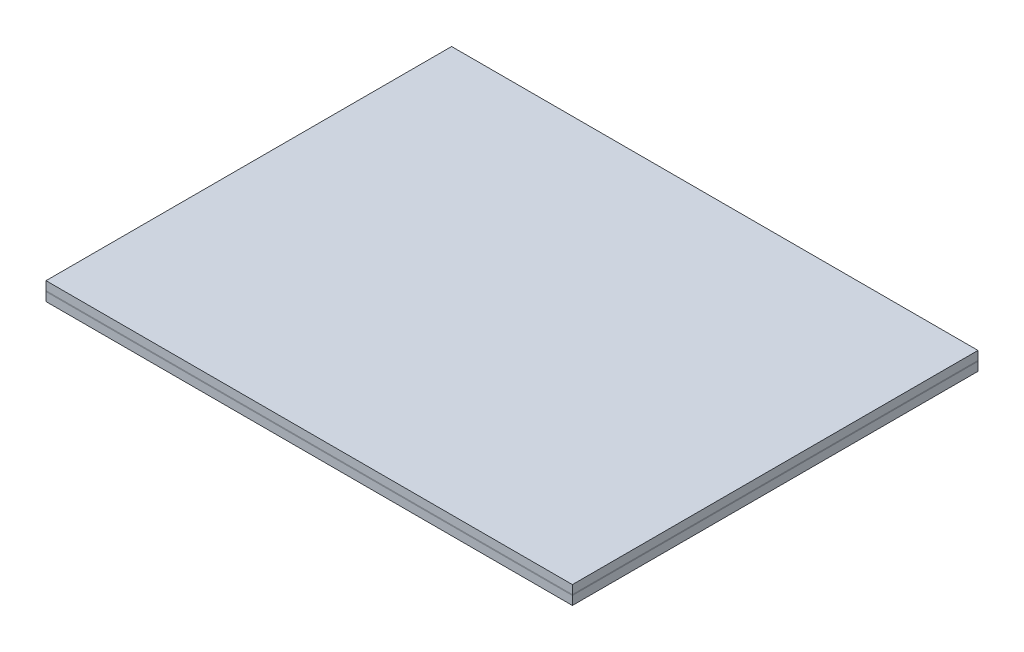
ISO-10303-21;
HEADER;
FILE_DESCRIPTION(('STEP AP214'),'2;1');
FILE_NAME('part.step','',(''),(''),'','','');
FILE_SCHEMA(('AUTOMOTIVE_DESIGN { 1 0 10303 214 1 1 1 1 }'));
ENDSEC;
DATA;
#1=APPLICATION_CONTEXT('core data for automotive mechanical design processes');
#2=APPLICATION_PROTOCOL_DEFINITION('international standard','automotive_design',2000,#1);
#3=PRODUCT_CONTEXT('',#1,'mechanical');
#4=PRODUCT('Part','Part','',(#3));
#5=PRODUCT_RELATED_PRODUCT_CATEGORY('part','',(#4));
#6=PRODUCT_DEFINITION_FORMATION('','',#4);
#7=PRODUCT_DEFINITION_CONTEXT('part definition',#1,'design');
#8=PRODUCT_DEFINITION('design','',#6,#7);
#9=PRODUCT_DEFINITION_SHAPE('','',#8);
#10=(LENGTH_UNIT() NAMED_UNIT(*) SI_UNIT(.MILLI.,.METRE.));
#11=(NAMED_UNIT(*) PLANE_ANGLE_UNIT() SI_UNIT($,.RADIAN.));
#12=(NAMED_UNIT(*) SI_UNIT($,.STERADIAN.) SOLID_ANGLE_UNIT());
#13=UNCERTAINTY_MEASURE_WITH_UNIT(LENGTH_MEASURE(1.E-05),#10,'distance_accuracy_value','');
#14=(GEOMETRIC_REPRESENTATION_CONTEXT(3) GLOBAL_UNCERTAINTY_ASSIGNED_CONTEXT((#13)) GLOBAL_UNIT_ASSIGNED_CONTEXT((#10,
#11,#12)) REPRESENTATION_CONTEXT('',''));
#15=CARTESIAN_POINT('',(0.,0.,0.));
#16=DIRECTION('',(0.,0.,1.));
#17=DIRECTION('',(1.,0.,0.));
#18=AXIS2_PLACEMENT_3D('',#15,#16,#17);
#19=CARTESIAN_POINT('',(0.,2.1,-15.0940695296524));
#20=DIRECTION('',(0.,0.,1.));
#21=DIRECTION('',(1.,0.,0.));
#22=AXIS2_PLACEMENT_3D('',#19,#20,#21);
#23=PLANE('',#22);
#24=DIRECTION('',(-1.,0.,0.));
#25=VECTOR('',#24,1.);
#26=CARTESIAN_POINT('',(0.,1.1,-15.0940695296524));
#27=LINE('',#26,#25);
#28=CARTESIAN_POINT('',(33.4314928425358,1.1,-15.0940695296524));
#29=VERTEX_POINT('',#28);
#30=CARTESIAN_POINT('',(-27.5685071574642,1.1,-15.0940695296524));
#31=VERTEX_POINT('',#30);
#32=EDGE_CURVE('E109',#29,#31,#27,.T.);
#33=ORIENTED_EDGE('',*,*,#32,.T.);
#34=DIRECTION('',(0.,-1.,0.));
#35=VECTOR('',#34,1.);
#36=CARTESIAN_POINT('',(-27.5685071574642,2.1,-15.0940695296524));
#37=LINE('',#36,#35);
#38=CARTESIAN_POINT('',(-27.5685071574642,2.1,-15.0940695296524));
#39=VERTEX_POINT('',#38);
#40=EDGE_CURVE('E12',#39,#31,#37,.T.);
#41=ORIENTED_EDGE('',*,*,#40,.F.);
#42=DIRECTION('',(-1.,0.,0.));
#43=VECTOR('',#42,1.);
#44=CARTESIAN_POINT('',(0.,2.1,-15.0940695296524));
#45=LINE('',#44,#43);
#46=CARTESIAN_POINT('',(33.4314928425358,2.1,-15.0940695296524));
#47=VERTEX_POINT('',#46);
#48=EDGE_CURVE('E97',#47,#39,#45,.T.);
#49=ORIENTED_EDGE('',*,*,#48,.F.);
#50=DIRECTION('',(0.,-1.,0.));
#51=VECTOR('',#50,1.);
#52=CARTESIAN_POINT('',(33.4314928425358,2.1,-15.0940695296524));
#53=LINE('',#52,#51);
#54=EDGE_CURVE('E105',#47,#29,#53,.T.);
#55=ORIENTED_EDGE('',*,*,#54,.T.);
#56=EDGE_LOOP('',(#33,#41,#49,#55));
#57=FACE_BOUND('',#56,.T.);
#58=ADVANCED_FACE('F46',(#57),#23,.F.);
#59=CARTESIAN_POINT('',(-27.5685071574642,2.1,0.));
#60=DIRECTION('',(1.,0.,0.));
#61=DIRECTION('',(0.,0.,-1.));
#62=AXIS2_PLACEMENT_3D('',#59,#60,#61);
#63=PLANE('',#62);
#64=DIRECTION('',(0.,0.,1.));
#65=VECTOR('',#64,1.);
#66=CARTESIAN_POINT('',(-27.5685071574642,1.1,0.));
#67=LINE('',#66,#65);
#68=CARTESIAN_POINT('',(-27.5685071574642,1.1,31.9059304703476));
#69=VERTEX_POINT('',#68);
#70=EDGE_CURVE('E101',#31,#69,#67,.T.);
#71=ORIENTED_EDGE('',*,*,#70,.T.);
#72=DIRECTION('',(0.,-1.,0.));
#73=VECTOR('',#72,1.);
#74=CARTESIAN_POINT('',(-27.5685071574642,2.1,31.9059304703476));
#75=LINE('',#74,#73);
#76=CARTESIAN_POINT('',(-27.5685071574642,2.1,31.9059304703476));
#77=VERTEX_POINT('',#76);
#78=EDGE_CURVE('E54',#77,#69,#75,.T.);
#79=ORIENTED_EDGE('',*,*,#78,.F.);
#80=DIRECTION('',(0.,0.,1.));
#81=VECTOR('',#80,1.);
#82=CARTESIAN_POINT('',(-27.5685071574642,2.1,0.));
#83=LINE('',#82,#81);
#84=EDGE_CURVE('E92',#39,#77,#83,.T.);
#85=ORIENTED_EDGE('',*,*,#84,.F.);
#86=ORIENTED_EDGE('',*,*,#40,.T.);
#87=EDGE_LOOP('',(#71,#79,#85,#86));
#88=FACE_BOUND('',#87,.T.);
#89=ADVANCED_FACE('F100',(#88),#63,.F.);
#90=CARTESIAN_POINT('',(0.,2.1,31.9059304703476));
#91=DIRECTION('',(0.,0.,-1.));
#92=DIRECTION('',(-1.,0.,0.));
#93=AXIS2_PLACEMENT_3D('',#90,#91,#92);
#94=PLANE('',#93);
#95=DIRECTION('',(1.,0.,0.));
#96=VECTOR('',#95,1.);
#97=CARTESIAN_POINT('',(0.,1.1,31.9059304703476));
#98=LINE('',#97,#96);
#99=CARTESIAN_POINT('',(33.4314928425358,1.1,31.9059304703476));
#100=VERTEX_POINT('',#99);
#101=EDGE_CURVE('E79',#69,#100,#98,.T.);
#102=ORIENTED_EDGE('',*,*,#101,.T.);
#103=DIRECTION('',(0.,-1.,0.));
#104=VECTOR('',#103,1.);
#105=CARTESIAN_POINT('',(33.4314928425358,2.1,31.9059304703476));
#106=LINE('',#105,#104);
#107=CARTESIAN_POINT('',(33.4314928425358,2.1,31.9059304703476));
#108=VERTEX_POINT('',#107);
#109=EDGE_CURVE('E102',#108,#100,#106,.T.);
#110=ORIENTED_EDGE('',*,*,#109,.F.);
#111=DIRECTION('',(1.,0.,0.));
#112=VECTOR('',#111,1.);
#113=CARTESIAN_POINT('',(0.,2.1,31.9059304703476));
#114=LINE('',#113,#112);
#115=EDGE_CURVE('E95',#77,#108,#114,.T.);
#116=ORIENTED_EDGE('',*,*,#115,.F.);
#117=ORIENTED_EDGE('',*,*,#78,.T.);
#118=EDGE_LOOP('',(#102,#110,#116,#117));
#119=FACE_BOUND('',#118,.T.);
#120=ADVANCED_FACE('F103',(#119),#94,.F.);
#121=CARTESIAN_POINT('',(33.4314928425358,2.1,0.));
#122=DIRECTION('',(-1.,0.,0.));
#123=DIRECTION('',(0.,0.,1.));
#124=AXIS2_PLACEMENT_3D('',#121,#122,#123);
#125=PLANE('',#124);
#126=DIRECTION('',(0.,0.,-1.));
#127=VECTOR('',#126,1.);
#128=CARTESIAN_POINT('',(33.4314928425358,1.1,0.));
#129=LINE('',#128,#127);
#130=EDGE_CURVE('E85',#100,#29,#129,.T.);
#131=ORIENTED_EDGE('',*,*,#130,.T.);
#132=ORIENTED_EDGE('',*,*,#54,.F.);
#133=DIRECTION('',(0.,0.,-1.));
#134=VECTOR('',#133,1.);
#135=CARTESIAN_POINT('',(33.4314928425358,2.1,0.));
#136=LINE('',#135,#134);
#137=EDGE_CURVE('E62',#108,#47,#136,.T.);
#138=ORIENTED_EDGE('',*,*,#137,.F.);
#139=ORIENTED_EDGE('',*,*,#109,.T.);
#140=EDGE_LOOP('',(#131,#132,#138,#139));
#141=FACE_BOUND('',#140,.T.);
#142=ADVANCED_FACE('F116',(#141),#125,.F.);
#143=CARTESIAN_POINT('',(0.,2.1,0.));
#144=DIRECTION('',(0.,1.,0.));
#145=DIRECTION('',(0.,0.,1.));
#146=AXIS2_PLACEMENT_3D('',#143,#144,#145);
#147=PLANE('',#146);
#148=ORIENTED_EDGE('',*,*,#48,.T.);
#149=ORIENTED_EDGE('',*,*,#84,.T.);
#150=ORIENTED_EDGE('',*,*,#115,.T.);
#151=ORIENTED_EDGE('',*,*,#137,.T.);
#152=EDGE_LOOP('',(#148,#149,#150,#151));
#153=FACE_BOUND('',#152,.T.);
#154=ADVANCED_FACE('F93',(#153),#147,.T.);
#155=CARTESIAN_POINT('',(0.,1.1,0.));
#156=DIRECTION('',(0.,1.,0.));
#157=DIRECTION('',(0.,0.,1.));
#158=AXIS2_PLACEMENT_3D('',#155,#156,#157);
#159=PLANE('',#158);
#160=ORIENTED_EDGE('',*,*,#32,.F.);
#161=ORIENTED_EDGE('',*,*,#130,.F.);
#162=ORIENTED_EDGE('',*,*,#101,.F.);
#163=ORIENTED_EDGE('',*,*,#70,.F.);
#164=EDGE_LOOP('',(#160,#161,#162,#163));
#165=FACE_BOUND('',#164,.T.);
#166=ADVANCED_FACE('F119',(#165),#159,.F.);
#167=CLOSED_SHELL('',(#58,#89,#120,#142,#154,#166));
#168=MANIFOLD_SOLID_BREP('B2',#167);
#169=CARTESIAN_POINT('',(0.,1.1,0.));
#170=DIRECTION('',(0.,-1.,0.));
#171=DIRECTION('',(0.,0.,-1.));
#172=AXIS2_PLACEMENT_3D('',#169,#170,#171);
#173=PLANE('',#172);
#174=DIRECTION('',(0.,0.,1.));
#175=VECTOR('',#174,1.);
#176=CARTESIAN_POINT('',(-27.5685071574642,1.1,31.9059304703476));
#177=LINE('',#176,#175);
#178=CARTESIAN_POINT('',(-27.5685071574642,1.1,-15.0940695296524));
#179=VERTEX_POINT('',#178);
#180=CARTESIAN_POINT('',(-27.5685071574642,1.1,31.9059304703476));
#181=VERTEX_POINT('',#180);
#182=EDGE_CURVE('E292',#179,#181,#177,.T.);
#183=ORIENTED_EDGE('',*,*,#182,.T.);
#184=DIRECTION('',(1.,0.,0.));
#185=VECTOR('',#184,1.);
#186=CARTESIAN_POINT('',(33.4314928425358,1.1,31.9059304703476));
#187=LINE('',#186,#185);
#188=CARTESIAN_POINT('',(33.4314928425358,1.1,31.9059304703476));
#189=VERTEX_POINT('',#188);
#190=EDGE_CURVE('E295',#181,#189,#187,.T.);
#191=ORIENTED_EDGE('',*,*,#190,.T.);
#192=DIRECTION('',(0.,0.,-1.));
#193=VECTOR('',#192,1.);
#194=CARTESIAN_POINT('',(33.4314928425358,1.1,-15.0940695296524));
#195=LINE('',#194,#193);
#196=CARTESIAN_POINT('',(33.4314928425358,1.1,-15.0940695296524));
#197=VERTEX_POINT('',#196);
#198=EDGE_CURVE('E298',#189,#197,#195,.T.);
#199=ORIENTED_EDGE('',*,*,#198,.T.);
#200=DIRECTION('',(-1.,0.,0.));
#201=VECTOR('',#200,1.);
#202=CARTESIAN_POINT('',(-27.5685071574642,1.1,-15.0940695296524));
#203=LINE('',#202,#201);
#204=EDGE_CURVE('E300',#197,#179,#203,.T.);
#205=ORIENTED_EDGE('',*,*,#204,.T.);
#206=EDGE_LOOP('',(#183,#191,#199,#205));
#207=FACE_BOUND('',#206,.T.);
#208=DIRECTION('',(-1.,0.,0.));
#209=VECTOR('',#208,1.);
#210=CARTESIAN_POINT('',(31.9314928425358,1.1,-13.5940695296524));
#211=LINE('',#210,#209);
#212=CARTESIAN_POINT('',(31.9314928425358,1.1,-13.5940695296524));
#213=VERTEX_POINT('',#212);
#214=CARTESIAN_POINT('',(-25.0685071574642,1.1,-13.5940695296524));
#215=VERTEX_POINT('',#214);
#216=EDGE_CURVE('E256',#213,#215,#211,.T.);
#217=ORIENTED_EDGE('',*,*,#216,.F.);
#218=DIRECTION('',(0.,0.,-1.));
#219=VECTOR('',#218,1.);
#220=CARTESIAN_POINT('',(31.9314928425358,1.1,30.4059304703476));
#221=LINE('',#220,#219);
#222=CARTESIAN_POINT('',(31.9314928425358,1.1,30.4059304703476));
#223=VERTEX_POINT('',#222);
#224=EDGE_CURVE('E278',#223,#213,#221,.T.);
#225=ORIENTED_EDGE('',*,*,#224,.F.);
#226=DIRECTION('',(1.,0.,0.));
#227=VECTOR('',#226,1.);
#228=CARTESIAN_POINT('',(-25.0685071574642,1.1,30.4059304703476));
#229=LINE('',#228,#227);
#230=CARTESIAN_POINT('',(-25.0685071574642,1.1,30.4059304703476));
#231=VERTEX_POINT('',#230);
#232=EDGE_CURVE('E276',#231,#223,#229,.T.);
#233=ORIENTED_EDGE('',*,*,#232,.F.);
#234=DIRECTION('',(0.,0.,1.));
#235=VECTOR('',#234,1.);
#236=CARTESIAN_POINT('',(-25.0685071574642,1.1,-13.5940695296524));
#237=LINE('',#236,#235);
#238=EDGE_CURVE('E264',#215,#231,#237,.T.);
#239=ORIENTED_EDGE('',*,*,#238,.F.);
#240=EDGE_LOOP('',(#217,#225,#233,#239));
#241=FACE_BOUND('',#240,.T.);
#242=ADVANCED_FACE('F191',(#207,#241),#173,.F.);
#243=CARTESIAN_POINT('',(0.,1.,0.));
#244=DIRECTION('',(0.,-1.,0.));
#245=DIRECTION('',(0.,0.,-1.));
#246=AXIS2_PLACEMENT_3D('',#243,#244,#245);
#247=PLANE('',#246);
#248=DIRECTION('',(0.,0.,1.));
#249=VECTOR('',#248,1.);
#250=CARTESIAN_POINT('',(-27.5685071574642,1.,31.9059304703476));
#251=LINE('',#250,#249);
#252=CARTESIAN_POINT('',(-27.5685071574642,1.,-15.0940695296524));
#253=VERTEX_POINT('',#252);
#254=CARTESIAN_POINT('',(-27.5685071574642,1.,31.9059304703476));
#255=VERTEX_POINT('',#254);
#256=EDGE_CURVE('E272',#253,#255,#251,.T.);
#257=ORIENTED_EDGE('',*,*,#256,.F.);
#258=DIRECTION('',(-1.,0.,0.));
#259=VECTOR('',#258,1.);
#260=CARTESIAN_POINT('',(-27.5685071574642,1.,-15.0940695296524));
#261=LINE('',#260,#259);
#262=CARTESIAN_POINT('',(33.4314928425358,1.,-15.0940695296524));
#263=VERTEX_POINT('',#262);
#264=EDGE_CURVE('E296',#263,#253,#261,.T.);
#265=ORIENTED_EDGE('',*,*,#264,.F.);
#266=DIRECTION('',(0.,0.,-1.));
#267=VECTOR('',#266,1.);
#268=CARTESIAN_POINT('',(33.4314928425358,1.,-15.0940695296524));
#269=LINE('',#268,#267);
#270=CARTESIAN_POINT('',(33.4314928425358,1.,31.9059304703476));
#271=VERTEX_POINT('',#270);
#272=EDGE_CURVE('E307',#271,#263,#269,.T.);
#273=ORIENTED_EDGE('',*,*,#272,.F.);
#274=DIRECTION('',(1.,0.,0.));
#275=VECTOR('',#274,1.);
#276=CARTESIAN_POINT('',(33.4314928425358,1.,31.9059304703476));
#277=LINE('',#276,#275);
#278=EDGE_CURVE('E305',#255,#271,#277,.T.);
#279=ORIENTED_EDGE('',*,*,#278,.F.);
#280=EDGE_LOOP('',(#257,#265,#273,#279));
#281=FACE_BOUND('',#280,.T.);
#282=DIRECTION('',(0.,0.,-1.));
#283=VECTOR('',#282,1.);
#284=CARTESIAN_POINT('',(31.9314928425358,1.,30.4059304703476));
#285=LINE('',#284,#283);
#286=CARTESIAN_POINT('',(31.9314928425358,1.,30.4059304703476));
#287=VERTEX_POINT('',#286);
#288=CARTESIAN_POINT('',(31.9314928425358,1.,-13.5940695296524));
#289=VERTEX_POINT('',#288);
#290=EDGE_CURVE('E265',#287,#289,#285,.T.);
#291=ORIENTED_EDGE('',*,*,#290,.T.);
#292=DIRECTION('',(-1.,0.,0.));
#293=VECTOR('',#292,1.);
#294=CARTESIAN_POINT('',(31.9314928425358,1.,-13.5940695296524));
#295=LINE('',#294,#293);
#296=CARTESIAN_POINT('',(-25.0685071574642,1.,-13.5940695296524));
#297=VERTEX_POINT('',#296);
#298=EDGE_CURVE('E214',#289,#297,#295,.T.);
#299=ORIENTED_EDGE('',*,*,#298,.T.);
#300=DIRECTION('',(0.,0.,1.));
#301=VECTOR('',#300,1.);
#302=CARTESIAN_POINT('',(-25.0685071574642,1.,-13.5940695296524));
#303=LINE('',#302,#301);
#304=CARTESIAN_POINT('',(-25.0685071574642,1.,30.4059304703476));
#305=VERTEX_POINT('',#304);
#306=EDGE_CURVE('E271',#297,#305,#303,.T.);
#307=ORIENTED_EDGE('',*,*,#306,.T.);
#308=DIRECTION('',(1.,0.,0.));
#309=VECTOR('',#308,1.);
#310=CARTESIAN_POINT('',(-25.0685071574642,1.,30.4059304703476));
#311=LINE('',#310,#309);
#312=EDGE_CURVE('E284',#305,#287,#311,.T.);
#313=ORIENTED_EDGE('',*,*,#312,.T.);
#314=EDGE_LOOP('',(#291,#299,#307,#313));
#315=FACE_BOUND('',#314,.T.);
#316=ADVANCED_FACE('F325',(#281,#315),#247,.T.);
#317=CARTESIAN_POINT('',(-27.5685071574642,1.1,31.9059304703476));
#318=DIRECTION('',(1.,0.,0.));
#319=DIRECTION('',(0.,0.,-1.));
#320=AXIS2_PLACEMENT_3D('',#317,#318,#319);
#321=PLANE('',#320);
#322=ORIENTED_EDGE('',*,*,#256,.T.);
#323=DIRECTION('',(0.,-1.,0.));
#324=VECTOR('',#323,1.);
#325=CARTESIAN_POINT('',(-27.5685071574642,1.1,31.9059304703476));
#326=LINE('',#325,#324);
#327=EDGE_CURVE('E44',#181,#255,#326,.T.);
#328=ORIENTED_EDGE('',*,*,#327,.F.);
#329=ORIENTED_EDGE('',*,*,#182,.F.);
#330=DIRECTION('',(0.,-1.,0.));
#331=VECTOR('',#330,1.);
#332=CARTESIAN_POINT('',(-27.5685071574642,1.1,-15.0940695296524));
#333=LINE('',#332,#331);
#334=EDGE_CURVE('E302',#179,#253,#333,.T.);
#335=ORIENTED_EDGE('',*,*,#334,.T.);
#336=EDGE_LOOP('',(#322,#328,#329,#335));
#337=FACE_BOUND('',#336,.T.);
#338=ADVANCED_FACE('F193',(#337),#321,.F.);
#339=CARTESIAN_POINT('',(33.4314928425358,1.1,31.9059304703476));
#340=DIRECTION('',(0.,0.,-1.));
#341=DIRECTION('',(-1.,0.,0.));
#342=AXIS2_PLACEMENT_3D('',#339,#340,#341);
#343=PLANE('',#342);
#344=ORIENTED_EDGE('',*,*,#278,.T.);
#345=DIRECTION('',(0.,-1.,0.));
#346=VECTOR('',#345,1.);
#347=CARTESIAN_POINT('',(33.4314928425358,1.1,31.9059304703476));
#348=LINE('',#347,#346);
#349=EDGE_CURVE('E199',#189,#271,#348,.T.);
#350=ORIENTED_EDGE('',*,*,#349,.F.);
#351=ORIENTED_EDGE('',*,*,#190,.F.);
#352=ORIENTED_EDGE('',*,*,#327,.T.);
#353=EDGE_LOOP('',(#344,#350,#351,#352));
#354=FACE_BOUND('',#353,.T.);
#355=ADVANCED_FACE('F335',(#354),#343,.F.);
#356=CARTESIAN_POINT('',(33.4314928425358,1.1,-15.0940695296524));
#357=DIRECTION('',(-1.,0.,0.));
#358=DIRECTION('',(0.,0.,1.));
#359=AXIS2_PLACEMENT_3D('',#356,#357,#358);
#360=PLANE('',#359);
#361=ORIENTED_EDGE('',*,*,#272,.T.);
#362=DIRECTION('',(0.,-1.,0.));
#363=VECTOR('',#362,1.);
#364=CARTESIAN_POINT('',(33.4314928425358,1.1,-15.0940695296524));
#365=LINE('',#364,#363);
#366=EDGE_CURVE('E312',#197,#263,#365,.T.);
#367=ORIENTED_EDGE('',*,*,#366,.F.);
#368=ORIENTED_EDGE('',*,*,#198,.F.);
#369=ORIENTED_EDGE('',*,*,#349,.T.);
#370=EDGE_LOOP('',(#361,#367,#368,#369));
#371=FACE_BOUND('',#370,.T.);
#372=ADVANCED_FACE('F319',(#371),#360,.F.);
#373=CARTESIAN_POINT('',(-27.5685071574642,1.1,-15.0940695296524));
#374=DIRECTION('',(0.,0.,1.));
#375=DIRECTION('',(1.,0.,0.));
#376=AXIS2_PLACEMENT_3D('',#373,#374,#375);
#377=PLANE('',#376);
#378=ORIENTED_EDGE('',*,*,#264,.T.);
#379=ORIENTED_EDGE('',*,*,#334,.F.);
#380=ORIENTED_EDGE('',*,*,#204,.F.);
#381=ORIENTED_EDGE('',*,*,#366,.T.);
#382=EDGE_LOOP('',(#378,#379,#380,#381));
#383=FACE_BOUND('',#382,.T.);
#384=ADVANCED_FACE('F329',(#383),#377,.F.);
#385=CARTESIAN_POINT('',(31.9314928425358,1.1,-13.5940695296524));
#386=DIRECTION('',(0.,0.,1.));
#387=DIRECTION('',(1.,0.,0.));
#388=AXIS2_PLACEMENT_3D('',#385,#386,#387);
#389=PLANE('',#388);
#390=ORIENTED_EDGE('',*,*,#298,.F.);
#391=DIRECTION('',(0.,-1.,0.));
#392=VECTOR('',#391,1.);
#393=CARTESIAN_POINT('',(31.9314928425358,1.1,-13.5940695296524));
#394=LINE('',#393,#392);
#395=EDGE_CURVE('E260',#213,#289,#394,.T.);
#396=ORIENTED_EDGE('',*,*,#395,.F.);
#397=ORIENTED_EDGE('',*,*,#216,.T.);
#398=DIRECTION('',(0.,-1.,0.));
#399=VECTOR('',#398,1.);
#400=CARTESIAN_POINT('',(-25.0685071574642,1.1,-13.5940695296524));
#401=LINE('',#400,#399);
#402=EDGE_CURVE('E259',#215,#297,#401,.T.);
#403=ORIENTED_EDGE('',*,*,#402,.T.);
#404=EDGE_LOOP('',(#390,#396,#397,#403));
#405=FACE_BOUND('',#404,.T.);
#406=ADVANCED_FACE('F258',(#405),#389,.T.);
#407=CARTESIAN_POINT('',(-25.0685071574642,1.1,-13.5940695296524));
#408=DIRECTION('',(1.,0.,0.));
#409=DIRECTION('',(0.,0.,-1.));
#410=AXIS2_PLACEMENT_3D('',#407,#408,#409);
#411=PLANE('',#410);
#412=ORIENTED_EDGE('',*,*,#306,.F.);
#413=ORIENTED_EDGE('',*,*,#402,.F.);
#414=ORIENTED_EDGE('',*,*,#238,.T.);
#415=DIRECTION('',(0.,-1.,0.));
#416=VECTOR('',#415,1.);
#417=CARTESIAN_POINT('',(-25.0685071574642,1.1,30.4059304703476));
#418=LINE('',#417,#416);
#419=EDGE_CURVE('E273',#231,#305,#418,.T.);
#420=ORIENTED_EDGE('',*,*,#419,.T.);
#421=EDGE_LOOP('',(#412,#413,#414,#420));
#422=FACE_BOUND('',#421,.T.);
#423=ADVANCED_FACE('F268',(#422),#411,.T.);
#424=CARTESIAN_POINT('',(-25.0685071574642,1.1,30.4059304703476));
#425=DIRECTION('',(0.,0.,-1.));
#426=DIRECTION('',(-1.,0.,0.));
#427=AXIS2_PLACEMENT_3D('',#424,#425,#426);
#428=PLANE('',#427);
#429=ORIENTED_EDGE('',*,*,#312,.F.);
#430=ORIENTED_EDGE('',*,*,#419,.F.);
#431=ORIENTED_EDGE('',*,*,#232,.T.);
#432=DIRECTION('',(0.,-1.,0.));
#433=VECTOR('',#432,1.);
#434=CARTESIAN_POINT('',(31.9314928425358,1.1,30.4059304703476));
#435=LINE('',#434,#433);
#436=EDGE_CURVE('E206',#223,#287,#435,.T.);
#437=ORIENTED_EDGE('',*,*,#436,.T.);
#438=EDGE_LOOP('',(#429,#430,#431,#437));
#439=FACE_BOUND('',#438,.T.);
#440=ADVANCED_FACE('F358',(#439),#428,.T.);
#441=CARTESIAN_POINT('',(31.9314928425358,1.1,30.4059304703476));
#442=DIRECTION('',(-1.,0.,0.));
#443=DIRECTION('',(0.,0.,1.));
#444=AXIS2_PLACEMENT_3D('',#441,#442,#443);
#445=PLANE('',#444);
#446=ORIENTED_EDGE('',*,*,#290,.F.);
#447=ORIENTED_EDGE('',*,*,#436,.F.);
#448=ORIENTED_EDGE('',*,*,#224,.T.);
#449=ORIENTED_EDGE('',*,*,#395,.T.);
#450=EDGE_LOOP('',(#446,#447,#448,#449));
#451=FACE_BOUND('',#450,.T.);
#452=ADVANCED_FACE('F362',(#451),#445,.T.);
#453=CLOSED_SHELL('',(#242,#316,#338,#355,#372,#384,#406,#423,#440,#452));
#454=MANIFOLD_SOLID_BREP('B6',#453);
#455=CARTESIAN_POINT('',(-27.5685071574642,1.,-15.0940695296524));
#456=DIRECTION('',(1.,0.,0.));
#457=DIRECTION('',(0.,0.,-1.));
#458=AXIS2_PLACEMENT_3D('',#455,#456,#457);
#459=PLANE('',#458);
#460=DIRECTION('',(0.,0.,1.));
#461=VECTOR('',#460,1.);
#462=CARTESIAN_POINT('',(-27.5685071574642,0.,-15.0940695296524));
#463=LINE('',#462,#461);
#464=CARTESIAN_POINT('',(-27.5685071574642,0.,-15.0940695296524));
#465=VERTEX_POINT('',#464);
#466=CARTESIAN_POINT('',(-27.5685071574642,0.,31.9059304703476));
#467=VERTEX_POINT('',#466);
#468=EDGE_CURVE('E484',#465,#467,#463,.T.);
#469=ORIENTED_EDGE('',*,*,#468,.T.);
#470=DIRECTION('',(0.,-1.,0.));
#471=VECTOR('',#470,1.);
#472=CARTESIAN_POINT('',(-27.5685071574642,1.,31.9059304703476));
#473=LINE('',#472,#471);
#474=CARTESIAN_POINT('',(-27.5685071574642,1.,31.9059304703476));
#475=VERTEX_POINT('',#474);
#476=EDGE_CURVE('E189',#475,#467,#473,.T.);
#477=ORIENTED_EDGE('',*,*,#476,.F.);
#478=DIRECTION('',(0.,0.,1.));
#479=VECTOR('',#478,1.);
#480=CARTESIAN_POINT('',(-27.5685071574642,1.,-15.0940695296524));
#481=LINE('',#480,#479);
#482=CARTESIAN_POINT('',(-27.5685071574642,1.,-15.0940695296524));
#483=VERTEX_POINT('',#482);
#484=EDGE_CURVE('E472',#483,#475,#481,.T.);
#485=ORIENTED_EDGE('',*,*,#484,.F.);
#486=DIRECTION('',(0.,-1.,0.));
#487=VECTOR('',#486,1.);
#488=CARTESIAN_POINT('',(-27.5685071574642,1.,-15.0940695296524));
#489=LINE('',#488,#487);
#490=EDGE_CURVE('E480',#483,#465,#489,.T.);
#491=ORIENTED_EDGE('',*,*,#490,.T.);
#492=EDGE_LOOP('',(#469,#477,#485,#491));
#493=FACE_BOUND('',#492,.T.);
#494=ADVANCED_FACE('F421',(#493),#459,.F.);
#495=CARTESIAN_POINT('',(-27.5685071574642,1.,31.9059304703476));
#496=DIRECTION('',(0.,0.,-1.));
#497=DIRECTION('',(-1.,0.,0.));
#498=AXIS2_PLACEMENT_3D('',#495,#496,#497);
#499=PLANE('',#498);
#500=DIRECTION('',(1.,0.,0.));
#501=VECTOR('',#500,1.);
#502=CARTESIAN_POINT('',(-27.5685071574642,0.,31.9059304703476));
#503=LINE('',#502,#501);
#504=CARTESIAN_POINT('',(33.4314928425358,0.,31.9059304703476));
#505=VERTEX_POINT('',#504);
#506=EDGE_CURVE('E476',#467,#505,#503,.T.);
#507=ORIENTED_EDGE('',*,*,#506,.T.);
#508=DIRECTION('',(0.,-1.,0.));
#509=VECTOR('',#508,1.);
#510=CARTESIAN_POINT('',(33.4314928425358,1.,31.9059304703476));
#511=LINE('',#510,#509);
#512=CARTESIAN_POINT('',(33.4314928425358,1.,31.9059304703476));
#513=VERTEX_POINT('',#512);
#514=EDGE_CURVE('E429',#513,#505,#511,.T.);
#515=ORIENTED_EDGE('',*,*,#514,.F.);
#516=DIRECTION('',(1.,0.,0.));
#517=VECTOR('',#516,1.);
#518=CARTESIAN_POINT('',(-27.5685071574642,1.,31.9059304703476));
#519=LINE('',#518,#517);
#520=EDGE_CURVE('E467',#475,#513,#519,.T.);
#521=ORIENTED_EDGE('',*,*,#520,.F.);
#522=ORIENTED_EDGE('',*,*,#476,.T.);
#523=EDGE_LOOP('',(#507,#515,#521,#522));
#524=FACE_BOUND('',#523,.T.);
#525=ADVANCED_FACE('F475',(#524),#499,.F.);
#526=CARTESIAN_POINT('',(33.4314928425358,1.,-15.0940695296524));
#527=DIRECTION('',(-1.,0.,0.));
#528=DIRECTION('',(0.,0.,1.));
#529=AXIS2_PLACEMENT_3D('',#526,#527,#528);
#530=PLANE('',#529);
#531=DIRECTION('',(0.,0.,-1.));
#532=VECTOR('',#531,1.);
#533=CARTESIAN_POINT('',(33.4314928425358,0.,-15.0940695296524));
#534=LINE('',#533,#532);
#535=CARTESIAN_POINT('',(33.4314928425358,0.,-15.0940695296524));
#536=VERTEX_POINT('',#535);
#537=EDGE_CURVE('E454',#505,#536,#534,.T.);
#538=ORIENTED_EDGE('',*,*,#537,.T.);
#539=DIRECTION('',(0.,-1.,0.));
#540=VECTOR('',#539,1.);
#541=CARTESIAN_POINT('',(33.4314928425358,1.,-15.0940695296524));
#542=LINE('',#541,#540);
#543=CARTESIAN_POINT('',(33.4314928425358,1.,-15.0940695296524));
#544=VERTEX_POINT('',#543);
#545=EDGE_CURVE('E477',#544,#536,#542,.T.);
#546=ORIENTED_EDGE('',*,*,#545,.F.);
#547=DIRECTION('',(0.,0.,-1.));
#548=VECTOR('',#547,1.);
#549=CARTESIAN_POINT('',(33.4314928425358,1.,-15.0940695296524));
#550=LINE('',#549,#548);
#551=EDGE_CURVE('E470',#513,#544,#550,.T.);
#552=ORIENTED_EDGE('',*,*,#551,.F.);
#553=ORIENTED_EDGE('',*,*,#514,.T.);
#554=EDGE_LOOP('',(#538,#546,#552,#553));
#555=FACE_BOUND('',#554,.T.);
#556=ADVANCED_FACE('F478',(#555),#530,.F.);
#557=CARTESIAN_POINT('',(-27.5685071574642,1.,-15.0940695296524));
#558=DIRECTION('',(0.,0.,1.));
#559=DIRECTION('',(1.,0.,0.));
#560=AXIS2_PLACEMENT_3D('',#557,#558,#559);
#561=PLANE('',#560);
#562=DIRECTION('',(-1.,0.,0.));
#563=VECTOR('',#562,1.);
#564=CARTESIAN_POINT('',(-27.5685071574642,0.,-15.0940695296524));
#565=LINE('',#564,#563);
#566=EDGE_CURVE('E460',#536,#465,#565,.T.);
#567=ORIENTED_EDGE('',*,*,#566,.T.);
#568=ORIENTED_EDGE('',*,*,#490,.F.);
#569=DIRECTION('',(-1.,0.,0.));
#570=VECTOR('',#569,1.);
#571=CARTESIAN_POINT('',(-27.5685071574642,1.,-15.0940695296524));
#572=LINE('',#571,#570);
#573=EDGE_CURVE('E437',#544,#483,#572,.T.);
#574=ORIENTED_EDGE('',*,*,#573,.F.);
#575=ORIENTED_EDGE('',*,*,#545,.T.);
#576=EDGE_LOOP('',(#567,#568,#574,#575));
#577=FACE_BOUND('',#576,.T.);
#578=ADVANCED_FACE('F491',(#577),#561,.F.);
#579=CARTESIAN_POINT('',(0.,1.,0.));
#580=DIRECTION('',(0.,1.,0.));
#581=DIRECTION('',(0.,0.,1.));
#582=AXIS2_PLACEMENT_3D('',#579,#580,#581);
#583=PLANE('',#582);
#584=ORIENTED_EDGE('',*,*,#484,.T.);
#585=ORIENTED_EDGE('',*,*,#520,.T.);
#586=ORIENTED_EDGE('',*,*,#551,.T.);
#587=ORIENTED_EDGE('',*,*,#573,.T.);
#588=EDGE_LOOP('',(#584,#585,#586,#587));
#589=FACE_BOUND('',#588,.T.);
#590=ADVANCED_FACE('F468',(#589),#583,.T.);
#591=CARTESIAN_POINT('',(0.,0.,0.));
#592=DIRECTION('',(0.,1.,0.));
#593=DIRECTION('',(0.,0.,1.));
#594=AXIS2_PLACEMENT_3D('',#591,#592,#593);
#595=PLANE('',#594);
#596=ORIENTED_EDGE('',*,*,#468,.F.);
#597=ORIENTED_EDGE('',*,*,#566,.F.);
#598=ORIENTED_EDGE('',*,*,#537,.F.);
#599=ORIENTED_EDGE('',*,*,#506,.F.);
#600=EDGE_LOOP('',(#596,#597,#598,#599));
#601=FACE_BOUND('',#600,.T.);
#602=ADVANCED_FACE('F494',(#601),#595,.F.);
#603=CLOSED_SHELL('',(#494,#525,#556,#578,#590,#602));
#604=MANIFOLD_SOLID_BREP('B38',#603);
#605=ADVANCED_BREP_SHAPE_REPRESENTATION('',(#18,#168,#454,#604),#14);
#606=SHAPE_DEFINITION_REPRESENTATION(#9,#605);
ENDSEC;
END-ISO-10303-21;
